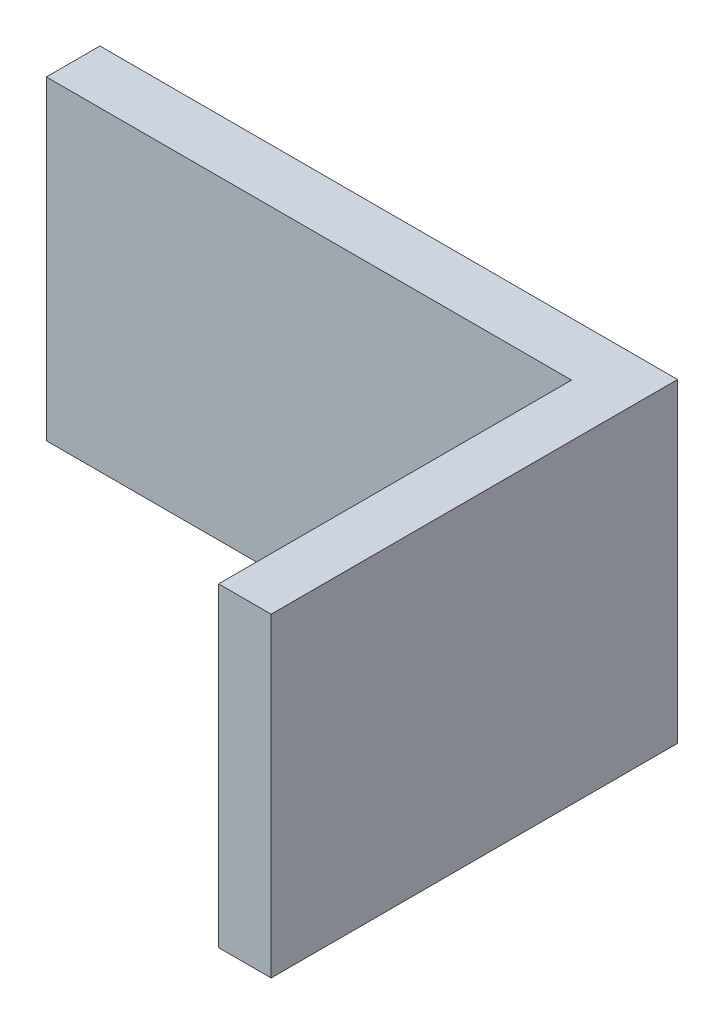
ISO-10303-21;
HEADER;
FILE_DESCRIPTION(('STEP AP214'),'2;1');
FILE_NAME('part.step','',(''),(''),'','','');
FILE_SCHEMA(('AUTOMOTIVE_DESIGN { 1 0 10303 214 1 1 1 1 }'));
ENDSEC;
DATA;
#1=APPLICATION_CONTEXT('core data for automotive mechanical design processes');
#2=APPLICATION_PROTOCOL_DEFINITION('international standard','automotive_design',2000,#1);
#3=PRODUCT_CONTEXT('',#1,'mechanical');
#4=PRODUCT('Part','Part','',(#3));
#5=PRODUCT_RELATED_PRODUCT_CATEGORY('part','',(#4));
#6=PRODUCT_DEFINITION_FORMATION('','',#4);
#7=PRODUCT_DEFINITION_CONTEXT('part definition',#1,'design');
#8=PRODUCT_DEFINITION('design','',#6,#7);
#9=PRODUCT_DEFINITION_SHAPE('','',#8);
#10=(LENGTH_UNIT() NAMED_UNIT(*) SI_UNIT(.MILLI.,.METRE.));
#11=(NAMED_UNIT(*) PLANE_ANGLE_UNIT() SI_UNIT($,.RADIAN.));
#12=(NAMED_UNIT(*) SI_UNIT($,.STERADIAN.) SOLID_ANGLE_UNIT());
#13=UNCERTAINTY_MEASURE_WITH_UNIT(LENGTH_MEASURE(1.E-05),#10,'distance_accuracy_value','');
#14=(GEOMETRIC_REPRESENTATION_CONTEXT(3) GLOBAL_UNCERTAINTY_ASSIGNED_CONTEXT((#13)) GLOBAL_UNIT_ASSIGNED_CONTEXT((#10,
#11,#12)) REPRESENTATION_CONTEXT('',''));
#15=CARTESIAN_POINT('',(0.,0.,0.));
#16=DIRECTION('',(0.,0.,1.));
#17=DIRECTION('',(1.,0.,0.));
#18=AXIS2_PLACEMENT_3D('',#15,#16,#17);
#19=CARTESIAN_POINT('',(4.55,0.9,0.));
#20=DIRECTION('',(0.,1.,0.));
#21=DIRECTION('',(0.,0.,1.));
#22=AXIS2_PLACEMENT_3D('',#19,#20,#21);
#23=PLANE('',#22);
#24=DIRECTION('',(1.,0.,0.));
#25=VECTOR('',#24,1.);
#26=CARTESIAN_POINT('',(4.,0.9,0.));
#27=LINE('',#26,#25);
#28=CARTESIAN_POINT('',(4.,0.9,0.));
#29=VERTEX_POINT('',#28);
#30=CARTESIAN_POINT('',(4.55,0.9,0.));
#31=VERTEX_POINT('',#30);
#32=EDGE_CURVE('E11',#29,#31,#27,.T.);
#33=ORIENTED_EDGE('',*,*,#32,.F.);
#34=DIRECTION('',(0.,0.,-1.));
#35=VECTOR('',#34,1.);
#36=CARTESIAN_POINT('',(4.,0.9,0.051));
#37=LINE('',#36,#35);
#38=CARTESIAN_POINT('',(4.,0.9,0.051));
#39=VERTEX_POINT('',#38);
#40=EDGE_CURVE('E24',#39,#29,#37,.T.);
#41=ORIENTED_EDGE('',*,*,#40,.F.);
#42=DIRECTION('',(-1.,0.,0.));
#43=VECTOR('',#42,1.);
#44=CARTESIAN_POINT('',(4.5,0.9,0.051));
#45=LINE('',#44,#43);
#46=CARTESIAN_POINT('',(4.5,0.9,0.051));
#47=VERTEX_POINT('',#46);
#48=EDGE_CURVE('E87',#47,#39,#45,.T.);
#49=ORIENTED_EDGE('',*,*,#48,.F.);
#50=DIRECTION('',(0.,0.,-1.));
#51=VECTOR('',#50,1.);
#52=CARTESIAN_POINT('',(4.5,0.9,0.387));
#53=LINE('',#52,#51);
#54=CARTESIAN_POINT('',(4.5,0.9,0.387));
#55=VERTEX_POINT('',#54);
#56=EDGE_CURVE('E114',#55,#47,#53,.T.);
#57=ORIENTED_EDGE('',*,*,#56,.F.);
#58=DIRECTION('',(-1.,0.,0.));
#59=VECTOR('',#58,1.);
#60=CARTESIAN_POINT('',(4.55,0.9,0.387));
#61=LINE('',#60,#59);
#62=CARTESIAN_POINT('',(4.55,0.9,0.387));
#63=VERTEX_POINT('',#62);
#64=EDGE_CURVE('E111',#63,#55,#61,.T.);
#65=ORIENTED_EDGE('',*,*,#64,.F.);
#66=DIRECTION('',(0.,0.,1.));
#67=VECTOR('',#66,1.);
#68=CARTESIAN_POINT('',(4.55,0.9,0.));
#69=LINE('',#68,#67);
#70=EDGE_CURVE('E108',#31,#63,#69,.T.);
#71=ORIENTED_EDGE('',*,*,#70,.F.);
#72=EDGE_LOOP('',(#33,#41,#49,#57,#65,#71));
#73=FACE_BOUND('',#72,.T.);
#74=ADVANCED_FACE('F17',(#73),#23,.T.);
#75=CARTESIAN_POINT('',(4.,0.6,0.));
#76=DIRECTION('',(0.,-1.,0.));
#77=DIRECTION('',(0.,0.,1.));
#78=AXIS2_PLACEMENT_3D('',#75,#76,#77);
#79=PLANE('',#78);
#80=DIRECTION('',(-1.,0.,0.));
#81=VECTOR('',#80,1.);
#82=CARTESIAN_POINT('',(4.55,0.6,0.));
#83=LINE('',#82,#81);
#84=CARTESIAN_POINT('',(4.55,0.6,0.));
#85=VERTEX_POINT('',#84);
#86=CARTESIAN_POINT('',(4.,0.6,0.));
#87=VERTEX_POINT('',#86);
#88=EDGE_CURVE('E106',#85,#87,#83,.T.);
#89=ORIENTED_EDGE('',*,*,#88,.F.);
#90=DIRECTION('',(0.,0.,-1.));
#91=VECTOR('',#90,1.);
#92=CARTESIAN_POINT('',(4.55,0.6,0.387));
#93=LINE('',#92,#91);
#94=CARTESIAN_POINT('',(4.55,0.6,0.387));
#95=VERTEX_POINT('',#94);
#96=EDGE_CURVE('E103',#95,#85,#93,.T.);
#97=ORIENTED_EDGE('',*,*,#96,.F.);
#98=DIRECTION('',(1.,0.,0.));
#99=VECTOR('',#98,1.);
#100=CARTESIAN_POINT('',(4.5,0.6,0.387));
#101=LINE('',#100,#99);
#102=CARTESIAN_POINT('',(4.5,0.6,0.387));
#103=VERTEX_POINT('',#102);
#104=EDGE_CURVE('E100',#103,#95,#101,.T.);
#105=ORIENTED_EDGE('',*,*,#104,.F.);
#106=DIRECTION('',(0.,0.,1.));
#107=VECTOR('',#106,1.);
#108=CARTESIAN_POINT('',(4.5,0.6,0.051));
#109=LINE('',#108,#107);
#110=CARTESIAN_POINT('',(4.5,0.6,0.051));
#111=VERTEX_POINT('',#110);
#112=EDGE_CURVE('E72',#111,#103,#109,.T.);
#113=ORIENTED_EDGE('',*,*,#112,.F.);
#114=DIRECTION('',(1.,0.,0.));
#115=VECTOR('',#114,1.);
#116=CARTESIAN_POINT('',(4.,0.6,0.051));
#117=LINE('',#116,#115);
#118=CARTESIAN_POINT('',(4.,0.6,0.051));
#119=VERTEX_POINT('',#118);
#120=EDGE_CURVE('E66',#119,#111,#117,.T.);
#121=ORIENTED_EDGE('',*,*,#120,.F.);
#122=DIRECTION('',(0.,0.,1.));
#123=VECTOR('',#122,1.);
#124=CARTESIAN_POINT('',(4.,0.6,0.));
#125=LINE('',#124,#123);
#126=EDGE_CURVE('E69',#87,#119,#125,.T.);
#127=ORIENTED_EDGE('',*,*,#126,.F.);
#128=EDGE_LOOP('',(#89,#97,#105,#113,#121,#127));
#129=FACE_BOUND('',#128,.T.);
#130=ADVANCED_FACE('F68',(#129),#79,.T.);
#131=CARTESIAN_POINT('',(4.55,0.9,0.387));
#132=DIRECTION('',(0.,0.,1.));
#133=DIRECTION('',(0.,1.,0.));
#134=AXIS2_PLACEMENT_3D('',#131,#132,#133);
#135=PLANE('',#134);
#136=ORIENTED_EDGE('',*,*,#64,.T.);
#137=DIRECTION('',(0.,1.,0.));
#138=VECTOR('',#137,1.);
#139=CARTESIAN_POINT('',(4.5,0.6,0.387));
#140=LINE('',#139,#138);
#141=EDGE_CURVE('E83',#103,#55,#140,.T.);
#142=ORIENTED_EDGE('',*,*,#141,.F.);
#143=ORIENTED_EDGE('',*,*,#104,.T.);
#144=DIRECTION('',(0.,-1.,0.));
#145=VECTOR('',#144,1.);
#146=CARTESIAN_POINT('',(4.55,0.9,0.387));
#147=LINE('',#146,#145);
#148=EDGE_CURVE('E88',#63,#95,#147,.T.);
#149=ORIENTED_EDGE('',*,*,#148,.F.);
#150=EDGE_LOOP('',(#136,#142,#143,#149));
#151=FACE_BOUND('',#150,.T.);
#152=ADVANCED_FACE('F125',(#151),#135,.T.);
#153=CARTESIAN_POINT('',(4.5,0.9,0.051));
#154=DIRECTION('',(0.,0.,1.));
#155=DIRECTION('',(0.,1.,0.));
#156=AXIS2_PLACEMENT_3D('',#153,#154,#155);
#157=PLANE('',#156);
#158=ORIENTED_EDGE('',*,*,#48,.T.);
#159=DIRECTION('',(0.,1.,0.));
#160=VECTOR('',#159,1.);
#161=CARTESIAN_POINT('',(4.,0.6,0.051));
#162=LINE('',#161,#160);
#163=EDGE_CURVE('E81',#119,#39,#162,.T.);
#164=ORIENTED_EDGE('',*,*,#163,.F.);
#165=ORIENTED_EDGE('',*,*,#120,.T.);
#166=DIRECTION('',(0.,-1.,0.));
#167=VECTOR('',#166,1.);
#168=CARTESIAN_POINT('',(4.5,0.9,0.051));
#169=LINE('',#168,#167);
#170=EDGE_CURVE('E89',#47,#111,#169,.T.);
#171=ORIENTED_EDGE('',*,*,#170,.F.);
#172=EDGE_LOOP('',(#158,#164,#165,#171));
#173=FACE_BOUND('',#172,.T.);
#174=ADVANCED_FACE('F86',(#173),#157,.T.);
#175=CARTESIAN_POINT('',(4.55,0.6,0.));
#176=DIRECTION('',(1.,0.,0.));
#177=DIRECTION('',(0.,0.,1.));
#178=AXIS2_PLACEMENT_3D('',#175,#176,#177);
#179=PLANE('',#178);
#180=DIRECTION('',(0.,-1.,0.));
#181=VECTOR('',#180,1.);
#182=CARTESIAN_POINT('',(4.55,0.9,0.));
#183=LINE('',#182,#181);
#184=EDGE_CURVE('E93',#31,#85,#183,.T.);
#185=ORIENTED_EDGE('',*,*,#184,.F.);
#186=ORIENTED_EDGE('',*,*,#70,.T.);
#187=ORIENTED_EDGE('',*,*,#148,.T.);
#188=ORIENTED_EDGE('',*,*,#96,.T.);
#189=EDGE_LOOP('',(#185,#186,#187,#188));
#190=FACE_BOUND('',#189,.T.);
#191=ADVANCED_FACE('F121',(#190),#179,.T.);
#192=CARTESIAN_POINT('',(4.,0.9,0.));
#193=DIRECTION('',(-1.,0.,0.));
#194=DIRECTION('',(0.,0.,1.));
#195=AXIS2_PLACEMENT_3D('',#192,#193,#194);
#196=PLANE('',#195);
#197=DIRECTION('',(0.,1.,0.));
#198=VECTOR('',#197,1.);
#199=CARTESIAN_POINT('',(4.,0.6,0.));
#200=LINE('',#199,#198);
#201=EDGE_CURVE('E82',#87,#29,#200,.T.);
#202=ORIENTED_EDGE('',*,*,#201,.F.);
#203=ORIENTED_EDGE('',*,*,#126,.T.);
#204=ORIENTED_EDGE('',*,*,#163,.T.);
#205=ORIENTED_EDGE('',*,*,#40,.T.);
#206=EDGE_LOOP('',(#202,#203,#204,#205));
#207=FACE_BOUND('',#206,.T.);
#208=ADVANCED_FACE('F80',(#207),#196,.T.);
#209=CARTESIAN_POINT('',(4.5,0.9,0.051));
#210=DIRECTION('',(-1.,0.,0.));
#211=DIRECTION('',(0.,0.,1.));
#212=AXIS2_PLACEMENT_3D('',#209,#210,#211);
#213=PLANE('',#212);
#214=ORIENTED_EDGE('',*,*,#170,.T.);
#215=ORIENTED_EDGE('',*,*,#112,.T.);
#216=ORIENTED_EDGE('',*,*,#141,.T.);
#217=ORIENTED_EDGE('',*,*,#56,.T.);
#218=EDGE_LOOP('',(#214,#215,#216,#217));
#219=FACE_BOUND('',#218,.T.);
#220=ADVANCED_FACE('F127',(#219),#213,.T.);
#221=CARTESIAN_POINT('',(4.55,0.6,0.));
#222=DIRECTION('',(0.,0.,-1.));
#223=DIRECTION('',(0.,1.,0.));
#224=AXIS2_PLACEMENT_3D('',#221,#222,#223);
#225=PLANE('',#224);
#226=ORIENTED_EDGE('',*,*,#88,.T.);
#227=ORIENTED_EDGE('',*,*,#201,.T.);
#228=ORIENTED_EDGE('',*,*,#32,.T.);
#229=ORIENTED_EDGE('',*,*,#184,.T.);
#230=EDGE_LOOP('',(#226,#227,#228,#229));
#231=FACE_BOUND('',#230,.T.);
#232=ADVANCED_FACE('F117',(#231),#225,.T.);
#233=CLOSED_SHELL('',(#74,#130,#152,#174,#191,#208,#220,#232));
#234=MANIFOLD_SOLID_BREP('B1',#233);
#235=ADVANCED_BREP_SHAPE_REPRESENTATION('',(#18,#234),#14);
#236=SHAPE_DEFINITION_REPRESENTATION(#9,#235);
ENDSEC;
END-ISO-10303-21;
